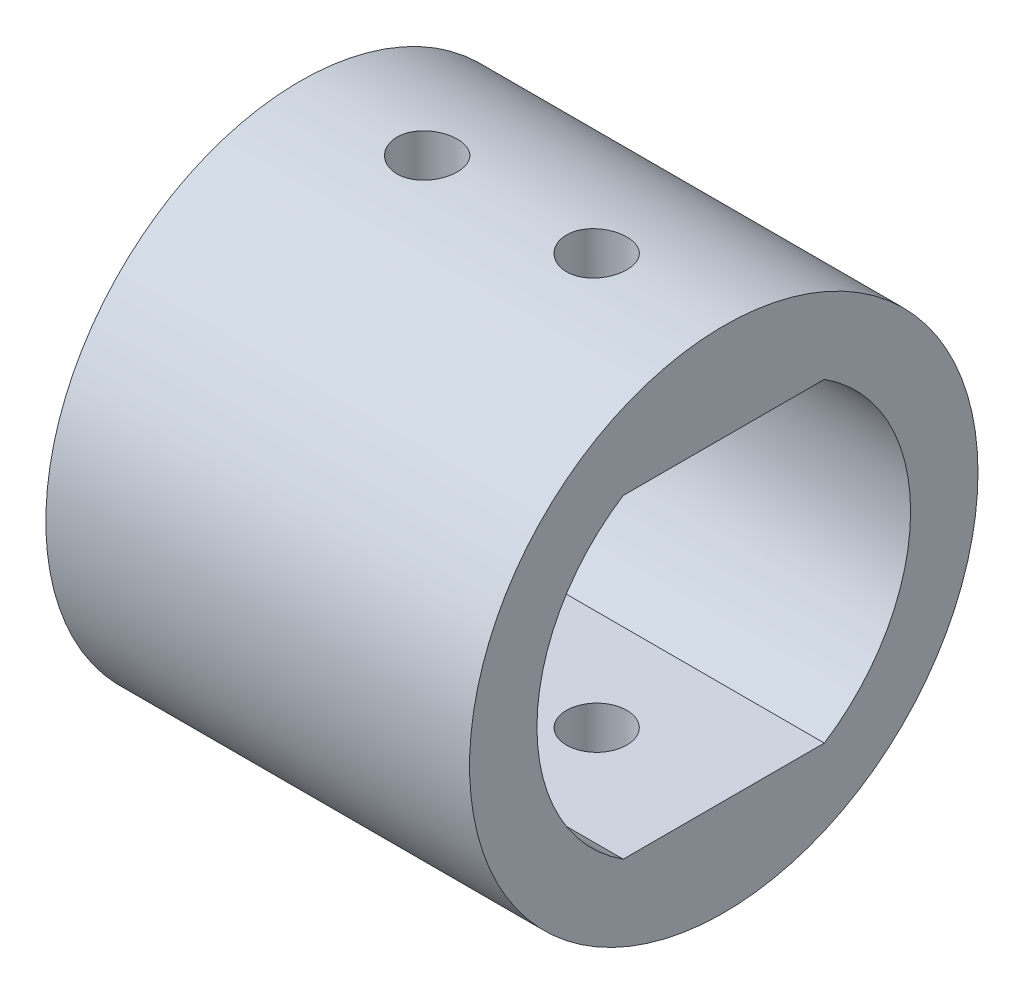
ISO-10303-21;
HEADER;
FILE_DESCRIPTION(('STEP AP214'),'2;1');
FILE_NAME('part.step','',(''),(''),'','','');
FILE_SCHEMA(('AUTOMOTIVE_DESIGN { 1 0 10303 214 1 1 1 1 }'));
ENDSEC;
DATA;
#1=APPLICATION_CONTEXT('core data for automotive mechanical design processes');
#2=APPLICATION_PROTOCOL_DEFINITION('international standard','automotive_design',2000,#1);
#3=PRODUCT_CONTEXT('',#1,'mechanical');
#4=PRODUCT('Part','Part','',(#3));
#5=PRODUCT_RELATED_PRODUCT_CATEGORY('part','',(#4));
#6=PRODUCT_DEFINITION_FORMATION('','',#4);
#7=PRODUCT_DEFINITION_CONTEXT('part definition',#1,'design');
#8=PRODUCT_DEFINITION('design','',#6,#7);
#9=PRODUCT_DEFINITION_SHAPE('','',#8);
#10=(LENGTH_UNIT() NAMED_UNIT(*) SI_UNIT(.MILLI.,.METRE.));
#11=(NAMED_UNIT(*) PLANE_ANGLE_UNIT() SI_UNIT($,.RADIAN.));
#12=(NAMED_UNIT(*) SI_UNIT($,.STERADIAN.) SOLID_ANGLE_UNIT());
#13=UNCERTAINTY_MEASURE_WITH_UNIT(LENGTH_MEASURE(1.E-05),#10,'distance_accuracy_value','');
#14=(GEOMETRIC_REPRESENTATION_CONTEXT(3) GLOBAL_UNCERTAINTY_ASSIGNED_CONTEXT((#13)) GLOBAL_UNIT_ASSIGNED_CONTEXT((#10,
#11,#12)) REPRESENTATION_CONTEXT('',''));
#15=CARTESIAN_POINT('',(0.,0.,0.));
#16=DIRECTION('',(0.,0.,1.));
#17=DIRECTION('',(1.,0.,0.));
#18=AXIS2_PLACEMENT_3D('',#15,#16,#17);
#19=CARTESIAN_POINT('',(7.9375,0.,0.));
#20=DIRECTION('',(-1.,0.,0.));
#21=DIRECTION('',(0.,0.,1.));
#22=AXIS2_PLACEMENT_3D('',#19,#20,#21);
#23=CYLINDRICAL_SURFACE('',#22,7.);
#24=CARTESIAN_POINT('',(-7.9375,0.,0.));
#25=DIRECTION('',(1.,0.,0.));
#26=DIRECTION('',(0.,0.,-1.));
#27=AXIS2_PLACEMENT_3D('',#24,#25,#26);
#28=CIRCLE('',#27,7.);
#29=CARTESIAN_POINT('',(-7.9375,5.9,3.76696164036747));
#30=VERTEX_POINT('',#29);
#31=CARTESIAN_POINT('',(-7.9375,-5.9,3.76696164036747));
#32=VERTEX_POINT('',#31);
#33=EDGE_CURVE('E122',#30,#32,#28,.T.);
#34=ORIENTED_EDGE('',*,*,#33,.F.);
#35=DIRECTION('',(-1.,0.,0.));
#36=VECTOR('',#35,1.);
#37=CARTESIAN_POINT('',(7.9375,5.9,3.76696164036747));
#38=LINE('',#37,#36);
#39=CARTESIAN_POINT('',(7.9375,5.9,3.76696164036747));
#40=VERTEX_POINT('',#39);
#41=EDGE_CURVE('E84',#40,#30,#38,.T.);
#42=ORIENTED_EDGE('',*,*,#41,.F.);
#43=CARTESIAN_POINT('',(7.9375,0.,0.));
#44=DIRECTION('',(1.,0.,0.));
#45=DIRECTION('',(0.,0.,-1.));
#46=AXIS2_PLACEMENT_3D('',#43,#44,#45);
#47=CIRCLE('',#46,7.);
#48=CARTESIAN_POINT('',(7.9375,-5.9,3.76696164036747));
#49=VERTEX_POINT('',#48);
#50=EDGE_CURVE('E97',#40,#49,#47,.T.);
#51=ORIENTED_EDGE('',*,*,#50,.T.);
#52=DIRECTION('',(-1.,0.,0.));
#53=VECTOR('',#52,1.);
#54=CARTESIAN_POINT('',(7.9375,-5.9,3.76696164036747));
#55=LINE('',#54,#53);
#56=EDGE_CURVE('E62',#49,#32,#55,.T.);
#57=ORIENTED_EDGE('',*,*,#56,.T.);
#58=EDGE_LOOP('',(#34,#42,#51,#57));
#59=FACE_BOUND('',#58,.T.);
#60=ADVANCED_FACE('F39',(#59),#23,.F.);
#61=CARTESIAN_POINT('',(7.9375,5.9,0.));
#62=DIRECTION('',(0.,1.,0.));
#63=DIRECTION('',(0.,0.,1.));
#64=AXIS2_PLACEMENT_3D('',#61,#62,#63);
#65=PLANE('',#64);
#66=CARTESIAN_POINT('',(-3.175,5.9,0.));
#67=DIRECTION('',(0.,1.,0.));
#68=DIRECTION('',(0.,0.,1.));
#69=AXIS2_PLACEMENT_3D('',#66,#67,#68);
#70=CIRCLE('',#69,1.1303);
#71=CARTESIAN_POINT('',(-3.175,5.9,1.1303));
#72=VERTEX_POINT('',#71);
#73=EDGE_CURVE('E125',#72,#72,#70,.T.);
#74=ORIENTED_EDGE('',*,*,#73,.T.);
#75=EDGE_LOOP('',(#74));
#76=FACE_BOUND('',#75,.T.);
#77=CARTESIAN_POINT('',(3.175,5.9,0.));
#78=DIRECTION('',(0.,1.,0.));
#79=DIRECTION('',(0.,0.,1.));
#80=AXIS2_PLACEMENT_3D('',#77,#78,#79);
#81=CIRCLE('',#80,1.1303);
#82=CARTESIAN_POINT('',(3.175,5.9,1.1303));
#83=VERTEX_POINT('',#82);
#84=EDGE_CURVE('E199',#83,#83,#81,.T.);
#85=ORIENTED_EDGE('',*,*,#84,.T.);
#86=EDGE_LOOP('',(#85));
#87=FACE_BOUND('',#86,.T.);
#88=DIRECTION('',(0.,0.,-1.));
#89=VECTOR('',#88,1.);
#90=CARTESIAN_POINT('',(-7.9375,5.9,0.));
#91=LINE('',#90,#89);
#92=CARTESIAN_POINT('',(-7.9375,5.9,-3.76696164036747));
#93=VERTEX_POINT('',#92);
#94=EDGE_CURVE('E105',#30,#93,#91,.T.);
#95=ORIENTED_EDGE('',*,*,#94,.T.);
#96=DIRECTION('',(-1.,0.,0.));
#97=VECTOR('',#96,1.);
#98=CARTESIAN_POINT('',(7.9375,5.9,-3.76696164036747));
#99=LINE('',#98,#97);
#100=CARTESIAN_POINT('',(7.9375,5.9,-3.76696164036747));
#101=VERTEX_POINT('',#100);
#102=EDGE_CURVE('E102',#101,#93,#99,.T.);
#103=ORIENTED_EDGE('',*,*,#102,.F.);
#104=DIRECTION('',(0.,0.,-1.));
#105=VECTOR('',#104,1.);
#106=CARTESIAN_POINT('',(7.9375,5.9,0.));
#107=LINE('',#106,#105);
#108=EDGE_CURVE('E90',#40,#101,#107,.T.);
#109=ORIENTED_EDGE('',*,*,#108,.F.);
#110=ORIENTED_EDGE('',*,*,#41,.T.);
#111=EDGE_LOOP('',(#95,#103,#109,#110));
#112=FACE_BOUND('',#111,.T.);
#113=ADVANCED_FACE('F103',(#76,#87,#112),#65,.F.);
#114=CARTESIAN_POINT('',(7.9375,0.,0.));
#115=DIRECTION('',(-1.,0.,0.));
#116=DIRECTION('',(0.,0.,1.));
#117=AXIS2_PLACEMENT_3D('',#114,#115,#116);
#118=CYLINDRICAL_SURFACE('',#117,7.);
#119=CARTESIAN_POINT('',(-7.9375,0.,0.));
#120=DIRECTION('',(1.,0.,0.));
#121=DIRECTION('',(0.,0.,-1.));
#122=AXIS2_PLACEMENT_3D('',#119,#120,#121);
#123=CIRCLE('',#122,7.);
#124=CARTESIAN_POINT('',(-7.9375,-5.9,-3.76696164036747));
#125=VERTEX_POINT('',#124);
#126=EDGE_CURVE('E128',#125,#93,#123,.T.);
#127=ORIENTED_EDGE('',*,*,#126,.F.);
#128=DIRECTION('',(-1.,0.,0.));
#129=VECTOR('',#128,1.);
#130=CARTESIAN_POINT('',(7.9375,-5.9,-3.76696164036747));
#131=LINE('',#130,#129);
#132=CARTESIAN_POINT('',(7.9375,-5.9,-3.76696164036747));
#133=VERTEX_POINT('',#132);
#134=EDGE_CURVE('E76',#133,#125,#131,.T.);
#135=ORIENTED_EDGE('',*,*,#134,.F.);
#136=CARTESIAN_POINT('',(7.9375,0.,0.));
#137=DIRECTION('',(1.,0.,0.));
#138=DIRECTION('',(0.,0.,-1.));
#139=AXIS2_PLACEMENT_3D('',#136,#137,#138);
#140=CIRCLE('',#139,7.);
#141=EDGE_CURVE('E96',#133,#101,#140,.T.);
#142=ORIENTED_EDGE('',*,*,#141,.T.);
#143=ORIENTED_EDGE('',*,*,#102,.T.);
#144=EDGE_LOOP('',(#127,#135,#142,#143));
#145=FACE_BOUND('',#144,.T.);
#146=ADVANCED_FACE('F110',(#145),#118,.F.);
#147=CARTESIAN_POINT('',(7.9375,-5.9,0.));
#148=DIRECTION('',(0.,1.,0.));
#149=DIRECTION('',(0.,0.,1.));
#150=AXIS2_PLACEMENT_3D('',#147,#148,#149);
#151=PLANE('',#150);
#152=CARTESIAN_POINT('',(-3.175,-5.9,0.));
#153=DIRECTION('',(0.,1.,0.));
#154=DIRECTION('',(0.,0.,1.));
#155=AXIS2_PLACEMENT_3D('',#152,#153,#154);
#156=CIRCLE('',#155,1.1303);
#157=CARTESIAN_POINT('',(-3.175,-5.9,1.1303));
#158=VERTEX_POINT('',#157);
#159=EDGE_CURVE('E193',#158,#158,#156,.T.);
#160=ORIENTED_EDGE('',*,*,#159,.F.);
#161=EDGE_LOOP('',(#160));
#162=FACE_BOUND('',#161,.T.);
#163=CARTESIAN_POINT('',(3.175,-5.9,0.));
#164=DIRECTION('',(0.,1.,0.));
#165=DIRECTION('',(0.,0.,1.));
#166=AXIS2_PLACEMENT_3D('',#163,#164,#165);
#167=CIRCLE('',#166,1.1303);
#168=CARTESIAN_POINT('',(3.175,-5.9,1.1303));
#169=VERTEX_POINT('',#168);
#170=EDGE_CURVE('E196',#169,#169,#167,.T.);
#171=ORIENTED_EDGE('',*,*,#170,.F.);
#172=EDGE_LOOP('',(#171));
#173=FACE_BOUND('',#172,.T.);
#174=DIRECTION('',(0.,0.,-1.));
#175=VECTOR('',#174,1.);
#176=CARTESIAN_POINT('',(-7.9375,-5.9,0.));
#177=LINE('',#176,#175);
#178=EDGE_CURVE('E131',#32,#125,#177,.T.);
#179=ORIENTED_EDGE('',*,*,#178,.F.);
#180=ORIENTED_EDGE('',*,*,#56,.F.);
#181=DIRECTION('',(0.,0.,-1.));
#182=VECTOR('',#181,1.);
#183=CARTESIAN_POINT('',(7.9375,-5.9,0.));
#184=LINE('',#183,#182);
#185=EDGE_CURVE('E112',#49,#133,#184,.T.);
#186=ORIENTED_EDGE('',*,*,#185,.T.);
#187=ORIENTED_EDGE('',*,*,#134,.T.);
#188=EDGE_LOOP('',(#179,#180,#186,#187));
#189=FACE_BOUND('',#188,.T.);
#190=ADVANCED_FACE('F181',(#162,#173,#189),#151,.T.);
#191=CARTESIAN_POINT('',(7.9375,0.,0.));
#192=DIRECTION('',(-1.,0.,0.));
#193=DIRECTION('',(0.,0.,1.));
#194=AXIS2_PLACEMENT_3D('',#191,#192,#193);
#195=CYLINDRICAL_SURFACE('',#194,9.525);
#196=CARTESIAN_POINT('',(-3.175,9.45769775949729,1.1303));
#197=CARTESIAN_POINT('',(-3.23824916976848,9.45769862718058,1.13029729598091));
#198=CARTESIAN_POINT('',(-3.30153849953314,9.45833908328995,1.12497316275731));
#199=CARTESIAN_POINT('',(-3.42635762857342,9.46083090750719,1.10381729162108));
#200=CARTESIAN_POINT('',(-3.48788548939699,9.46268355989146,1.08797440922644));
#201=CARTESIAN_POINT('',(-3.60735632461924,9.46738704222719,1.04625308620623));
#202=CARTESIAN_POINT('',(-3.66530163170046,9.47023721444242,1.02038125717666));
#203=CARTESIAN_POINT('',(-3.77601666251184,9.47661379731083,0.959350224752229));
#204=CARTESIAN_POINT('',(-3.82878730780231,9.48014008722181,0.924192679193433));
#205=CARTESIAN_POINT('',(-3.92793325161707,9.48749155945359,0.845397586021794));
#206=CARTESIAN_POINT('',(-3.97427860824603,9.491318019046,0.801722478390805));
#207=CARTESIAN_POINT('',(-4.05899996894538,9.49882717289779,0.70721277256907));
#208=CARTESIAN_POINT('',(-4.09737558547415,9.50250986015894,0.656377826421095));
#209=CARTESIAN_POINT('',(-4.16517461646272,9.50932950061834,0.548804366863592));
#210=CARTESIAN_POINT('',(-4.19457107215468,9.51246479850961,0.492048748609835));
#211=CARTESIAN_POINT('',(-4.24340471319634,9.5178223911594,0.374363093305485));
#212=CARTESIAN_POINT('',(-4.26284223326057,9.52004471660192,0.313433196628211));
#213=CARTESIAN_POINT('',(-4.29111716550103,9.52331697940384,0.189434001960021));
#214=CARTESIAN_POINT('',(-4.30000422990086,9.52437240675603,0.126376173112619));
#215=CARTESIAN_POINT('',(-4.30707979205946,9.52521068375437,-0.000344122305609714));
#216=CARTESIAN_POINT('',(-4.30526867144282,9.52499357879418,-0.0640065672277504));
#217=CARTESIAN_POINT('',(-4.29103920606598,9.5233157085376,-0.189791341572358));
#218=CARTESIAN_POINT('',(-4.2786742581653,9.52186120395862,-0.251919806779137));
#219=CARTESIAN_POINT('',(-4.24377152603821,9.51787903391902,-0.373213518763547));
#220=CARTESIAN_POINT('',(-4.22123356473929,9.51535134977857,-0.432378713942282));
#221=CARTESIAN_POINT('',(-4.16656731052756,9.50949608877205,-0.546232535258128));
#222=CARTESIAN_POINT('',(-4.1344157673226,9.50616657654033,-0.60090989433039));
#223=CARTESIAN_POINT('',(-4.06145191720071,9.49908046607103,-0.704113036985985));
#224=CARTESIAN_POINT('',(-4.02063925222401,9.49532385017953,-0.752638566113756));
#225=CARTESIAN_POINT('',(-3.93121226959251,9.48777694820432,-0.842474035276456));
#226=CARTESIAN_POINT('',(-3.88255143868043,9.48398659726572,-0.883737681950874));
#227=CARTESIAN_POINT('',(-3.77896961346334,9.4768223283503,-0.957518652670657));
#228=CARTESIAN_POINT('',(-3.72404860286375,9.47344841145744,-0.990035953949487));
#229=CARTESIAN_POINT('',(-3.6094657322383,9.46749898010504,-1.0454030436631));
#230=CARTESIAN_POINT('',(-3.54980217711299,9.46492375274304,-1.06824935683133));
#231=CARTESIAN_POINT('',(-3.42744821943478,9.46086898380371,-1.10358611116931));
#232=CARTESIAN_POINT('',(-3.36475794802235,9.45938939480026,-1.11607700058983));
#233=CARTESIAN_POINT('',(-3.23853829023288,9.45770199014614,-1.13028751220767));
#234=CARTESIAN_POINT('',(-3.17501632549279,9.45748649494197,-1.13207217777638));
#235=CARTESIAN_POINT('',(-3.04857854353881,9.4583313807212,-1.12499098103634));
#236=CARTESIAN_POINT('',(-2.98566271473382,9.45939173725754,-1.11612532280234));
#237=CARTESIAN_POINT('',(-2.86241660962486,9.46266185072345,-1.08804981318816));
#238=CARTESIAN_POINT('',(-2.80207910475548,9.46486812992943,-1.06887125391347));
#239=CARTESIAN_POINT('',(-2.68547666647221,9.47017867995706,-1.02074648918646));
#240=CARTESIAN_POINT('',(-2.62921186276153,9.47328297936222,-0.991799972820342));
#241=CARTESIAN_POINT('',(-2.5220570981924,9.48005824688151,-0.924800232377516));
#242=CARTESIAN_POINT('',(-2.47119405310682,9.48373184715418,-0.886704231529676));
#243=CARTESIAN_POINT('',(-2.37656078778812,9.49122344028545,-0.802547627123672));
#244=CARTESIAN_POINT('',(-2.33279081583712,9.4950414381927,-0.75648674488369));
#245=CARTESIAN_POINT('',(-2.25335882489087,9.50241511902043,-0.657424275109199));
#246=CARTESIAN_POINT('',(-2.21773946200383,9.50596935894309,-0.604388361657209));
#247=CARTESIAN_POINT('',(-2.15591449742253,9.51239364404868,-0.493048965900749));
#248=CARTESIAN_POINT('',(-2.12970872218702,9.51526370184431,-0.434745580727906));
#249=CARTESIAN_POINT('',(-2.08752576407364,9.51998981336182,-0.314669957235084));
#250=CARTESIAN_POINT('',(-2.07152362585643,9.5218483393725,-0.252906587121844));
#251=CARTESIAN_POINT('',(-2.05012092449964,9.52435221743971,-0.12754623527732));
#252=CARTESIAN_POINT('',(-2.04471993284648,9.52499761853245,-0.0639493277656949));
#253=CARTESIAN_POINT('',(-2.04468029857384,9.52500235390677,0.0628556479824202));
#254=CARTESIAN_POINT('',(-2.04997576236484,9.52436956226478,0.126063705513361));
#255=CARTESIAN_POINT('',(-2.07103953947349,9.52190462521891,0.250684984413589));
#256=CARTESIAN_POINT('',(-2.08680785031618,9.52007248009848,0.31209820620703));
#257=CARTESIAN_POINT('',(-2.12834966910498,9.51541385608962,0.431380067380626));
#258=CARTESIAN_POINT('',(-2.1541203486888,9.5125876583099,0.489249703426965));
#259=CARTESIAN_POINT('',(-2.21492853525092,9.50625444540433,0.599853154793376));
#260=CARTESIAN_POINT('',(-2.24996610802963,9.50274742544428,0.652586933642185));
#261=CARTESIAN_POINT('',(-2.32855835431538,9.49541862334329,0.751758792815968));
#262=CARTESIAN_POINT('',(-2.37216210287417,9.49159510470678,0.798157855449946));
#263=CARTESIAN_POINT('',(-2.46654788869246,9.48407840461348,0.883006880795346));
#264=CARTESIAN_POINT('',(-2.51733162909704,9.48038525434148,0.921454952130811));
#265=CARTESIAN_POINT('',(-2.62483714734645,9.47353370418922,0.98942342028143));
#266=CARTESIAN_POINT('',(-2.68157902520976,9.47037721505064,1.01891219974434));
#267=CARTESIAN_POINT('',(-2.79921387200613,9.46497883214028,1.06790149267205));
#268=CARTESIAN_POINT('',(-2.86010219624436,9.46273593404493,1.08741298037643));
#269=CARTESIAN_POINT('',(-2.96359510485225,9.45996908722804,1.11116894868368));
#270=CARTESIAN_POINT('',(-3.00554427963409,9.45912152185399,1.11833291869403));
#271=CARTESIAN_POINT('',(-3.08998959038909,9.4579855682106,1.12789933748409));
#272=CARTESIAN_POINT('',(-3.13248572276489,9.45769717626547,1.13030181756405));
#273=CARTESIAN_POINT('',(-3.175,9.45769775949729,1.1303));
#274=B_SPLINE_CURVE_WITH_KNOTS('',3,(#196,#197,#198,#199,#200,#201,#202,#203,#204,#205,#206,
#207,#208,#209,#210,#211,#212,#213,#214,#215,#216,#217,#218,#219,#220,#221,#222,#223,#224,#225,
#226,#227,#228,#229,#230,#231,#232,#233,#234,#235,#236,#237,#238,#239,#240,#241,#242,#243,#244,
#245,#246,#247,#248,#249,#250,#251,#252,#253,#254,#255,#256,#257,#258,#259,#260,#261,#262,#263,
#264,#265,#266,#267,#268,#269,#270,#271,#272,#273),.UNSPECIFIED.,.T.,.F.,(4,2,2,2,2,2,2,2,2,2,2,
2,2,2,2,2,2,2,2,2,2,2,2,2,2,2,2,2,2,2,2,2,2,2,2,2,2,2,4),(0.,0.18959221388925,0.379385619561867,
0.569054115897612,0.758688772414149,0.949179385544422,1.13967925942422,1.33074558653033,
1.52180549157747,1.71196262630949,1.90211297781599,2.09130693212657,2.28050417969351,
2.4701627505348,2.65982916358627,2.85066401887307,3.04149937089377,3.23240324144272,
3.42329884798683,3.61303352504167,3.80276456657905,3.99192313524191,4.18108772538462,
4.37115455334502,4.56122803286597,4.7522745994211,4.94331764381635,5.13389163804312,
5.32445792883671,5.51385385073963,5.70324972788426,5.89259208867053,6.08193579393566,
6.27239765084127,6.46290476268864,6.65407656758035,6.84503764369971,6.97247692802296,
7.09991537460509),.UNSPECIFIED.);
#275=CARTESIAN_POINT('',(-3.175,9.45769775949729,1.1303));
#276=VERTEX_POINT('',#275);
#277=EDGE_CURVE('E42',#276,#276,#274,.T.);
#278=ORIENTED_EDGE('',*,*,#277,.T.);
#279=EDGE_LOOP('',(#278));
#280=FACE_BOUND('',#279,.T.);
#281=CARTESIAN_POINT('',(-3.175,-9.45769775949729,1.1303));
#282=CARTESIAN_POINT('',(-3.11175083023152,-9.45769862718058,1.13029729598091));
#283=CARTESIAN_POINT('',(-3.04846150046686,-9.45833908328995,1.12497316275731));
#284=CARTESIAN_POINT('',(-2.92364237142658,-9.46083090750719,1.10381729162108));
#285=CARTESIAN_POINT('',(-2.86211451060301,-9.46268355989146,1.08797440922644));
#286=CARTESIAN_POINT('',(-2.74264367538076,-9.46738704222719,1.04625308620623));
#287=CARTESIAN_POINT('',(-2.68469836829954,-9.47023721444242,1.02038125717666));
#288=CARTESIAN_POINT('',(-2.57398333748816,-9.47661379731083,0.95935022475223));
#289=CARTESIAN_POINT('',(-2.52121269219769,-9.48014008722181,0.924192679193433));
#290=CARTESIAN_POINT('',(-2.42206674838293,-9.48749155945359,0.845397586021794));
#291=CARTESIAN_POINT('',(-2.37572139175397,-9.491318019046,0.801722478390805));
#292=CARTESIAN_POINT('',(-2.29100003105462,-9.49882717289779,0.707212772569069));
#293=CARTESIAN_POINT('',(-2.25262441452585,-9.50250986015894,0.656377826421095));
#294=CARTESIAN_POINT('',(-2.18482538353728,-9.50932950061834,0.548804366863592));
#295=CARTESIAN_POINT('',(-2.15542892784532,-9.51246479850961,0.492048748609835));
#296=CARTESIAN_POINT('',(-2.10659528680366,-9.5178223911594,0.374363093305484));
#297=CARTESIAN_POINT('',(-2.08715776673943,-9.52004471660192,0.313433196628211));
#298=CARTESIAN_POINT('',(-2.05888283449897,-9.52331697940384,0.189434001960021));
#299=CARTESIAN_POINT('',(-2.04999577009914,-9.52437240675603,0.126376173112619));
#300=CARTESIAN_POINT('',(-2.04292020794054,-9.52521068375437,-0.000344122305609903));
#301=CARTESIAN_POINT('',(-2.04473132855718,-9.52499357879418,-0.0640065672277506));
#302=CARTESIAN_POINT('',(-2.05896079393402,-9.5233157085376,-0.189791341572358));
#303=CARTESIAN_POINT('',(-2.0713257418347,-9.52186120395862,-0.251919806779137));
#304=CARTESIAN_POINT('',(-2.10622847396179,-9.51787903391902,-0.373213518763547));
#305=CARTESIAN_POINT('',(-2.12876643526071,-9.51535134977857,-0.432378713942282));
#306=CARTESIAN_POINT('',(-2.18343268947244,-9.50949608877205,-0.546232535258128));
#307=CARTESIAN_POINT('',(-2.2155842326774,-9.50616657654033,-0.60090989433039));
#308=CARTESIAN_POINT('',(-2.28854808279929,-9.49908046607103,-0.704113036985985));
#309=CARTESIAN_POINT('',(-2.32936074777599,-9.49532385017953,-0.752638566113756));
#310=CARTESIAN_POINT('',(-2.41878773040749,-9.48777694820432,-0.842474035276456));
#311=CARTESIAN_POINT('',(-2.46744856131957,-9.48398659726572,-0.883737681950874));
#312=CARTESIAN_POINT('',(-2.57103038653666,-9.4768223283503,-0.957518652670657));
#313=CARTESIAN_POINT('',(-2.62595139713625,-9.47344841145744,-0.990035953949487));
#314=CARTESIAN_POINT('',(-2.7405342677617,-9.46749898010504,-1.0454030436631));
#315=CARTESIAN_POINT('',(-2.80019782288701,-9.46492375274304,-1.06824935683133));
#316=CARTESIAN_POINT('',(-2.92255178056522,-9.46086898380371,-1.10358611116931));
#317=CARTESIAN_POINT('',(-2.98524205197765,-9.45938939480026,-1.11607700058983));
#318=CARTESIAN_POINT('',(-3.11146170976712,-9.45770199014614,-1.13028751220767));
#319=CARTESIAN_POINT('',(-3.17498367450721,-9.45748649494197,-1.13207217777638));
#320=CARTESIAN_POINT('',(-3.30142145646119,-9.4583313807212,-1.12499098103634));
#321=CARTESIAN_POINT('',(-3.36433728526618,-9.45939173725754,-1.11612532280234));
#322=CARTESIAN_POINT('',(-3.48758339037514,-9.46266185072345,-1.08804981318816));
#323=CARTESIAN_POINT('',(-3.54792089524452,-9.46486812992943,-1.06887125391347));
#324=CARTESIAN_POINT('',(-3.66452333352779,-9.47017867995706,-1.02074648918646));
#325=CARTESIAN_POINT('',(-3.72078813723847,-9.47328297936222,-0.991799972820342));
#326=CARTESIAN_POINT('',(-3.8279429018076,-9.48005824688151,-0.924800232377515));
#327=CARTESIAN_POINT('',(-3.87880594689318,-9.48373184715418,-0.886704231529675));
#328=CARTESIAN_POINT('',(-3.97343921221188,-9.49122344028545,-0.802547627123672));
#329=CARTESIAN_POINT('',(-4.01720918416288,-9.4950414381927,-0.756486744883689));
#330=CARTESIAN_POINT('',(-4.09664117510913,-9.50241511902043,-0.657424275109199));
#331=CARTESIAN_POINT('',(-4.13226053799617,-9.50596935894309,-0.604388361657209));
#332=CARTESIAN_POINT('',(-4.19408550257748,-9.51239364404868,-0.49304896590075));
#333=CARTESIAN_POINT('',(-4.22029127781298,-9.51526370184431,-0.434745580727906));
#334=CARTESIAN_POINT('',(-4.26247423592636,-9.51998981336182,-0.314669957235084));
#335=CARTESIAN_POINT('',(-4.27847637414357,-9.5218483393725,-0.252906587121844));
#336=CARTESIAN_POINT('',(-4.29987907550036,-9.52435221743971,-0.127546235277319));
#337=CARTESIAN_POINT('',(-4.30528006715352,-9.52499761853245,-0.0639493277656946));
#338=CARTESIAN_POINT('',(-4.30531970142616,-9.52500235390677,0.0628556479824207));
#339=CARTESIAN_POINT('',(-4.30002423763516,-9.52436956226478,0.126063705513362));
#340=CARTESIAN_POINT('',(-4.27896046052651,-9.52190462521891,0.25068498441359));
#341=CARTESIAN_POINT('',(-4.26319214968382,-9.52007248009848,0.312098206207031));
#342=CARTESIAN_POINT('',(-4.22165033089502,-9.51541385608962,0.431380067380627));
#343=CARTESIAN_POINT('',(-4.1958796513112,-9.5125876583099,0.489249703426966));
#344=CARTESIAN_POINT('',(-4.13507146474908,-9.50625444540433,0.599853154793377));
#345=CARTESIAN_POINT('',(-4.10003389197037,-9.50274742544428,0.652586933642186));
#346=CARTESIAN_POINT('',(-4.02144164568462,-9.49541862334329,0.751758792815968));
#347=CARTESIAN_POINT('',(-3.97783789712583,-9.49159510470678,0.798157855449947));
#348=CARTESIAN_POINT('',(-3.88345211130754,-9.48407840461348,0.883006880795346));
#349=CARTESIAN_POINT('',(-3.83266837090296,-9.48038525434148,0.921454952130811));
#350=CARTESIAN_POINT('',(-3.72516285265355,-9.47353370418922,0.98942342028143));
#351=CARTESIAN_POINT('',(-3.66842097479024,-9.47037721505064,1.01891219974434));
#352=CARTESIAN_POINT('',(-3.55078612799387,-9.46497883214028,1.06790149267205));
#353=CARTESIAN_POINT('',(-3.48989780375564,-9.46273593404493,1.08741298037643));
#354=CARTESIAN_POINT('',(-3.38640489514775,-9.45996908722804,1.11116894868368));
#355=CARTESIAN_POINT('',(-3.34445572036591,-9.45912152185399,1.11833291869403));
#356=CARTESIAN_POINT('',(-3.26001040961091,-9.4579855682106,1.12789933748409));
#357=CARTESIAN_POINT('',(-3.21751427723511,-9.45769717626547,1.13030181756405));
#358=CARTESIAN_POINT('',(-3.175,-9.45769775949729,1.1303));
#359=B_SPLINE_CURVE_WITH_KNOTS('',3,(#281,#282,#283,#284,#285,#286,#287,#288,#289,#290,#291,
#292,#293,#294,#295,#296,#297,#298,#299,#300,#301,#302,#303,#304,#305,#306,#307,#308,#309,#310,
#311,#312,#313,#314,#315,#316,#317,#318,#319,#320,#321,#322,#323,#324,#325,#326,#327,#328,#329,
#330,#331,#332,#333,#334,#335,#336,#337,#338,#339,#340,#341,#342,#343,#344,#345,#346,#347,#348,
#349,#350,#351,#352,#353,#354,#355,#356,#357,#358),.UNSPECIFIED.,.T.,.F.,(4,2,2,2,2,2,2,2,2,2,2,
2,2,2,2,2,2,2,2,2,2,2,2,2,2,2,2,2,2,2,2,2,2,2,2,2,2,2,4),(0.,0.18959221388925,0.379385619561867,
0.569054115897612,0.758688772414149,0.949179385544422,1.13967925942423,1.33074558653033,
1.52180549157747,1.71196262630949,1.90211297781599,2.09130693212657,2.28050417969351,
2.4701627505348,2.65982916358627,2.85066401887307,3.04149937089377,3.23240324144272,
3.42329884798683,3.61303352504167,3.80276456657905,3.99192313524191,4.18108772538462,
4.37115455334502,4.56122803286597,4.7522745994211,4.94331764381635,5.13389163804312,
5.32445792883671,5.51385385073963,5.70324972788426,5.89259208867053,6.08193579393566,
6.27239765084127,6.46290476268864,6.65407656758035,6.84503764369971,6.97247692802296,
7.09991537460509),.UNSPECIFIED.);
#360=CARTESIAN_POINT('',(-3.175,-9.45769775949729,1.1303));
#361=VERTEX_POINT('',#360);
#362=EDGE_CURVE('E11',#361,#361,#359,.T.);
#363=ORIENTED_EDGE('',*,*,#362,.T.);
#364=EDGE_LOOP('',(#363));
#365=FACE_BOUND('',#364,.T.);
#366=CARTESIAN_POINT('',(3.175,9.45769775949729,1.1303));
#367=CARTESIAN_POINT('',(3.11175083023152,9.45769862718058,1.13029729598091));
#368=CARTESIAN_POINT('',(3.04846150046686,9.45833908328995,1.12497316275731));
#369=CARTESIAN_POINT('',(2.92364237142658,9.46083090750719,1.10381729162108));
#370=CARTESIAN_POINT('',(2.86211451060301,9.46268355989146,1.08797440922644));
#371=CARTESIAN_POINT('',(2.74264367538076,9.46738704222719,1.04625308620623));
#372=CARTESIAN_POINT('',(2.68469836829954,9.47023721444242,1.02038125717666));
#373=CARTESIAN_POINT('',(2.57398333748816,9.47661379731083,0.95935022475223));
#374=CARTESIAN_POINT('',(2.52121269219769,9.48014008722181,0.924192679193433));
#375=CARTESIAN_POINT('',(2.42206674838293,9.48749155945359,0.845397586021794));
#376=CARTESIAN_POINT('',(2.37572139175397,9.491318019046,0.801722478390805));
#377=CARTESIAN_POINT('',(2.29100003105462,9.49882717289779,0.70721277256907));
#378=CARTESIAN_POINT('',(2.25262441452585,9.50250986015894,0.656377826421095));
#379=CARTESIAN_POINT('',(2.18482538353728,9.50932950061834,0.548804366863592));
#380=CARTESIAN_POINT('',(2.15542892784532,9.51246479850961,0.492048748609835));
#381=CARTESIAN_POINT('',(2.10659528680366,9.5178223911594,0.374363093305484));
#382=CARTESIAN_POINT('',(2.08715776673943,9.52004471660192,0.313433196628211));
#383=CARTESIAN_POINT('',(2.05888283449897,9.52331697940384,0.189434001960021));
#384=CARTESIAN_POINT('',(2.04999577009914,9.52437240675603,0.126376173112619));
#385=CARTESIAN_POINT('',(2.04292020794054,9.52521068375437,-0.000344122305609727));
#386=CARTESIAN_POINT('',(2.04473132855718,9.52499357879418,-0.0640065672277505));
#387=CARTESIAN_POINT('',(2.05896079393402,9.5233157085376,-0.189791341572358));
#388=CARTESIAN_POINT('',(2.0713257418347,9.52186120395862,-0.251919806779137));
#389=CARTESIAN_POINT('',(2.10622847396179,9.51787903391902,-0.373213518763548));
#390=CARTESIAN_POINT('',(2.12876643526071,9.51535134977857,-0.432378713942282));
#391=CARTESIAN_POINT('',(2.18343268947244,9.50949608877205,-0.546232535258129));
#392=CARTESIAN_POINT('',(2.2155842326774,9.50616657654033,-0.60090989433039));
#393=CARTESIAN_POINT('',(2.28854808279929,9.49908046607103,-0.704113036985985));
#394=CARTESIAN_POINT('',(2.32936074777599,9.49532385017953,-0.752638566113757));
#395=CARTESIAN_POINT('',(2.41878773040749,9.48777694820432,-0.842474035276456));
#396=CARTESIAN_POINT('',(2.46744856131957,9.48398659726572,-0.883737681950874));
#397=CARTESIAN_POINT('',(2.57103038653666,9.4768223283503,-0.957518652670657));
#398=CARTESIAN_POINT('',(2.62595139713625,9.47344841145744,-0.990035953949487));
#399=CARTESIAN_POINT('',(2.7405342677617,9.46749898010504,-1.0454030436631));
#400=CARTESIAN_POINT('',(2.80019782288701,9.46492375274304,-1.06824935683133));
#401=CARTESIAN_POINT('',(2.92255178056522,9.46086898380371,-1.10358611116931));
#402=CARTESIAN_POINT('',(2.98524205197765,9.45938939480026,-1.11607700058983));
#403=CARTESIAN_POINT('',(3.11146170976712,9.45770199014614,-1.13028751220767));
#404=CARTESIAN_POINT('',(3.17498367450721,9.45748649494197,-1.13207217777638));
#405=CARTESIAN_POINT('',(3.30142145646119,9.4583313807212,-1.12499098103634));
#406=CARTESIAN_POINT('',(3.36433728526618,9.45939173725754,-1.11612532280234));
#407=CARTESIAN_POINT('',(3.48758339037514,9.46266185072345,-1.08804981318816));
#408=CARTESIAN_POINT('',(3.54792089524452,9.46486812992943,-1.06887125391347));
#409=CARTESIAN_POINT('',(3.66452333352779,9.47017867995706,-1.02074648918646));
#410=CARTESIAN_POINT('',(3.72078813723847,9.47328297936222,-0.991799972820342));
#411=CARTESIAN_POINT('',(3.8279429018076,9.48005824688151,-0.924800232377515));
#412=CARTESIAN_POINT('',(3.87880594689318,9.48373184715418,-0.886704231529675));
#413=CARTESIAN_POINT('',(3.97343921221188,9.49122344028545,-0.802547627123672));
#414=CARTESIAN_POINT('',(4.01720918416288,9.4950414381927,-0.756486744883689));
#415=CARTESIAN_POINT('',(4.09664117510913,9.50241511902043,-0.657424275109199));
#416=CARTESIAN_POINT('',(4.13226053799617,9.50596935894309,-0.604388361657209));
#417=CARTESIAN_POINT('',(4.19408550257748,9.51239364404868,-0.49304896590075));
#418=CARTESIAN_POINT('',(4.22029127781298,9.51526370184431,-0.434745580727906));
#419=CARTESIAN_POINT('',(4.26247423592636,9.51998981336182,-0.314669957235084));
#420=CARTESIAN_POINT('',(4.27847637414357,9.5218483393725,-0.252906587121844));
#421=CARTESIAN_POINT('',(4.29987907550036,9.52435221743971,-0.127546235277319));
#422=CARTESIAN_POINT('',(4.30528006715352,9.52499761853245,-0.0639493277656945));
#423=CARTESIAN_POINT('',(4.30531970142616,9.52500235390677,0.0628556479824208));
#424=CARTESIAN_POINT('',(4.30002423763516,9.52436956226478,0.126063705513362));
#425=CARTESIAN_POINT('',(4.27896046052651,9.52190462521891,0.25068498441359));
#426=CARTESIAN_POINT('',(4.26319214968382,9.52007248009848,0.312098206207031));
#427=CARTESIAN_POINT('',(4.22165033089502,9.51541385608962,0.431380067380627));
#428=CARTESIAN_POINT('',(4.1958796513112,9.5125876583099,0.489249703426966));
#429=CARTESIAN_POINT('',(4.13507146474908,9.50625444540433,0.599853154793377));
#430=CARTESIAN_POINT('',(4.10003389197037,9.50274742544428,0.652586933642186));
#431=CARTESIAN_POINT('',(4.02144164568462,9.49541862334329,0.751758792815969));
#432=CARTESIAN_POINT('',(3.97783789712583,9.49159510470678,0.798157855449947));
#433=CARTESIAN_POINT('',(3.88345211130754,9.48407840461348,0.883006880795346));
#434=CARTESIAN_POINT('',(3.83266837090296,9.48038525434148,0.921454952130811));
#435=CARTESIAN_POINT('',(3.72516285265355,9.47353370418922,0.989423420281431));
#436=CARTESIAN_POINT('',(3.66842097479023,9.47037721505064,1.01891219974434));
#437=CARTESIAN_POINT('',(3.55078612799387,9.46497883214028,1.06790149267205));
#438=CARTESIAN_POINT('',(3.48989780375564,9.46273593404493,1.08741298037643));
#439=CARTESIAN_POINT('',(3.38640489514775,9.45996908722804,1.11116894868368));
#440=CARTESIAN_POINT('',(3.34445572036591,9.45912152185399,1.11833291869403));
#441=CARTESIAN_POINT('',(3.26001040961091,9.4579855682106,1.12789933748409));
#442=CARTESIAN_POINT('',(3.21751427723511,9.45769717626547,1.13030181756405));
#443=CARTESIAN_POINT('',(3.175,9.45769775949729,1.1303));
#444=B_SPLINE_CURVE_WITH_KNOTS('',3,(#366,#367,#368,#369,#370,#371,#372,#373,#374,#375,#376,
#377,#378,#379,#380,#381,#382,#383,#384,#385,#386,#387,#388,#389,#390,#391,#392,#393,#394,#395,
#396,#397,#398,#399,#400,#401,#402,#403,#404,#405,#406,#407,#408,#409,#410,#411,#412,#413,#414,
#415,#416,#417,#418,#419,#420,#421,#422,#423,#424,#425,#426,#427,#428,#429,#430,#431,#432,#433,
#434,#435,#436,#437,#438,#439,#440,#441,#442,#443),.UNSPECIFIED.,.T.,.F.,(4,2,2,2,2,2,2,2,2,2,2,
2,2,2,2,2,2,2,2,2,2,2,2,2,2,2,2,2,2,2,2,2,2,2,2,2,2,2,4),(0.,0.18959221388925,0.379385619561867,
0.569054115897611,0.758688772414149,0.949179385544422,1.13967925942423,1.33074558653033,
1.52180549157747,1.71196262630949,1.90211297781599,2.09130693212657,2.28050417969351,
2.4701627505348,2.65982916358627,2.85066401887307,3.04149937089377,3.23240324144272,
3.42329884798683,3.61303352504167,3.80276456657905,3.99192313524191,4.18108772538462,
4.37115455334502,4.56122803286597,4.7522745994211,4.94331764381635,5.13389163804312,
5.32445792883671,5.51385385073963,5.70324972788426,5.89259208867053,6.08193579393567,
6.27239765084127,6.46290476268864,6.65407656758035,6.84503764369971,6.97247692802296,
7.09991537460509),.UNSPECIFIED.);
#445=CARTESIAN_POINT('',(3.175,9.45769775949729,1.1303));
#446=VERTEX_POINT('',#445);
#447=EDGE_CURVE('E152',#446,#446,#444,.T.);
#448=ORIENTED_EDGE('',*,*,#447,.T.);
#449=EDGE_LOOP('',(#448));
#450=FACE_BOUND('',#449,.T.);
#451=CARTESIAN_POINT('',(3.175,-9.45769775949729,1.1303));
#452=CARTESIAN_POINT('',(3.23824916976848,-9.45769862718058,1.13029729598091));
#453=CARTESIAN_POINT('',(3.30153849953314,-9.45833908328995,1.12497316275731));
#454=CARTESIAN_POINT('',(3.42635762857342,-9.46083090750719,1.10381729162108));
#455=CARTESIAN_POINT('',(3.48788548939699,-9.46268355989146,1.08797440922644));
#456=CARTESIAN_POINT('',(3.60735632461924,-9.46738704222719,1.04625308620623));
#457=CARTESIAN_POINT('',(3.66530163170046,-9.47023721444242,1.02038125717666));
#458=CARTESIAN_POINT('',(3.77601666251184,-9.47661379731083,0.95935022475223));
#459=CARTESIAN_POINT('',(3.82878730780231,-9.48014008722181,0.924192679193433));
#460=CARTESIAN_POINT('',(3.92793325161707,-9.48749155945359,0.845397586021794));
#461=CARTESIAN_POINT('',(3.97427860824603,-9.491318019046,0.801722478390805));
#462=CARTESIAN_POINT('',(4.05899996894538,-9.49882717289779,0.70721277256907));
#463=CARTESIAN_POINT('',(4.09737558547415,-9.50250986015894,0.656377826421095));
#464=CARTESIAN_POINT('',(4.16517461646272,-9.50932950061834,0.548804366863592));
#465=CARTESIAN_POINT('',(4.19457107215468,-9.51246479850961,0.492048748609835));
#466=CARTESIAN_POINT('',(4.24340471319634,-9.5178223911594,0.374363093305484));
#467=CARTESIAN_POINT('',(4.26284223326057,-9.52004471660192,0.313433196628211));
#468=CARTESIAN_POINT('',(4.29111716550103,-9.52331697940384,0.189434001960021));
#469=CARTESIAN_POINT('',(4.30000422990086,-9.52437240675603,0.126376173112619));
#470=CARTESIAN_POINT('',(4.30707979205946,-9.52521068375437,-0.000344122305609727));
#471=CARTESIAN_POINT('',(4.30526867144282,-9.52499357879418,-0.0640065672277503));
#472=CARTESIAN_POINT('',(4.29103920606598,-9.5233157085376,-0.189791341572357));
#473=CARTESIAN_POINT('',(4.2786742581653,-9.52186120395862,-0.251919806779136));
#474=CARTESIAN_POINT('',(4.24377152603821,-9.51787903391902,-0.373213518763547));
#475=CARTESIAN_POINT('',(4.22123356473929,-9.51535134977857,-0.432378713942281));
#476=CARTESIAN_POINT('',(4.16656731052756,-9.50949608877205,-0.546232535258128));
#477=CARTESIAN_POINT('',(4.1344157673226,-9.50616657654033,-0.60090989433039));
#478=CARTESIAN_POINT('',(4.06145191720071,-9.49908046607103,-0.704113036985984));
#479=CARTESIAN_POINT('',(4.02063925222401,-9.49532385017953,-0.752638566113756));
#480=CARTESIAN_POINT('',(3.93121226959251,-9.48777694820432,-0.842474035276456));
#481=CARTESIAN_POINT('',(3.88255143868043,-9.48398659726572,-0.883737681950874));
#482=CARTESIAN_POINT('',(3.77896961346334,-9.4768223283503,-0.957518652670657));
#483=CARTESIAN_POINT('',(3.72404860286375,-9.47344841145744,-0.990035953949487));
#484=CARTESIAN_POINT('',(3.6094657322383,-9.46749898010504,-1.0454030436631));
#485=CARTESIAN_POINT('',(3.54980217711299,-9.46492375274304,-1.06824935683133));
#486=CARTESIAN_POINT('',(3.42744821943478,-9.46086898380371,-1.10358611116931));
#487=CARTESIAN_POINT('',(3.36475794802235,-9.45938939480026,-1.11607700058983));
#488=CARTESIAN_POINT('',(3.23853829023288,-9.45770199014614,-1.13028751220767));
#489=CARTESIAN_POINT('',(3.17501632549279,-9.45748649494197,-1.13207217777638));
#490=CARTESIAN_POINT('',(3.04857854353881,-9.4583313807212,-1.12499098103634));
#491=CARTESIAN_POINT('',(2.98566271473382,-9.45939173725754,-1.11612532280234));
#492=CARTESIAN_POINT('',(2.86241660962486,-9.46266185072345,-1.08804981318816));
#493=CARTESIAN_POINT('',(2.80207910475548,-9.46486812992943,-1.06887125391347));
#494=CARTESIAN_POINT('',(2.68547666647221,-9.47017867995706,-1.02074648918646));
#495=CARTESIAN_POINT('',(2.62921186276153,-9.47328297936222,-0.991799972820342));
#496=CARTESIAN_POINT('',(2.5220570981924,-9.48005824688151,-0.924800232377516));
#497=CARTESIAN_POINT('',(2.47119405310682,-9.48373184715418,-0.886704231529676));
#498=CARTESIAN_POINT('',(2.37656078778812,-9.49122344028545,-0.802547627123672));
#499=CARTESIAN_POINT('',(2.33279081583712,-9.4950414381927,-0.756486744883689));
#500=CARTESIAN_POINT('',(2.25335882489087,-9.50241511902043,-0.657424275109199));
#501=CARTESIAN_POINT('',(2.21773946200383,-9.50596935894309,-0.604388361657209));
#502=CARTESIAN_POINT('',(2.15591449742253,-9.51239364404868,-0.493048965900749));
#503=CARTESIAN_POINT('',(2.12970872218702,-9.51526370184431,-0.434745580727906));
#504=CARTESIAN_POINT('',(2.08752576407364,-9.51998981336182,-0.314669957235084));
#505=CARTESIAN_POINT('',(2.07152362585643,-9.5218483393725,-0.252906587121844));
#506=CARTESIAN_POINT('',(2.05012092449964,-9.52435221743971,-0.127546235277319));
#507=CARTESIAN_POINT('',(2.04471993284648,-9.52499761853245,-0.0639493277656947));
#508=CARTESIAN_POINT('',(2.04468029857384,-9.52500235390677,0.0628556479824205));
#509=CARTESIAN_POINT('',(2.04997576236484,-9.52436956226478,0.126063705513362));
#510=CARTESIAN_POINT('',(2.07103953947349,-9.52190462521891,0.25068498441359));
#511=CARTESIAN_POINT('',(2.08680785031618,-9.52007248009847,0.312098206207031));
#512=CARTESIAN_POINT('',(2.12834966910498,-9.51541385608962,0.431380067380626));
#513=CARTESIAN_POINT('',(2.1541203486888,-9.5125876583099,0.489249703426966));
#514=CARTESIAN_POINT('',(2.21492853525092,-9.50625444540433,0.599853154793376));
#515=CARTESIAN_POINT('',(2.24996610802963,-9.50274742544428,0.652586933642185));
#516=CARTESIAN_POINT('',(2.32855835431538,-9.49541862334329,0.751758792815968));
#517=CARTESIAN_POINT('',(2.37216210287417,-9.49159510470678,0.798157855449946));
#518=CARTESIAN_POINT('',(2.46654788869246,-9.48407840461348,0.883006880795345));
#519=CARTESIAN_POINT('',(2.51733162909704,-9.48038525434148,0.921454952130811));
#520=CARTESIAN_POINT('',(2.62483714734645,-9.47353370418922,0.98942342028143));
#521=CARTESIAN_POINT('',(2.68157902520976,-9.47037721505064,1.01891219974434));
#522=CARTESIAN_POINT('',(2.79921387200613,-9.46497883214028,1.06790149267205));
#523=CARTESIAN_POINT('',(2.86010219624436,-9.46273593404493,1.08741298037643));
#524=CARTESIAN_POINT('',(2.96359510485225,-9.45996908722804,1.11116894868368));
#525=CARTESIAN_POINT('',(3.00554427963409,-9.45912152185399,1.11833291869403));
#526=CARTESIAN_POINT('',(3.08998959038909,-9.4579855682106,1.12789933748409));
#527=CARTESIAN_POINT('',(3.13248572276489,-9.45769717626547,1.13030181756405));
#528=CARTESIAN_POINT('',(3.175,-9.45769775949729,1.1303));
#529=B_SPLINE_CURVE_WITH_KNOTS('',3,(#451,#452,#453,#454,#455,#456,#457,#458,#459,#460,#461,
#462,#463,#464,#465,#466,#467,#468,#469,#470,#471,#472,#473,#474,#475,#476,#477,#478,#479,#480,
#481,#482,#483,#484,#485,#486,#487,#488,#489,#490,#491,#492,#493,#494,#495,#496,#497,#498,#499,
#500,#501,#502,#503,#504,#505,#506,#507,#508,#509,#510,#511,#512,#513,#514,#515,#516,#517,#518,
#519,#520,#521,#522,#523,#524,#525,#526,#527,#528),.UNSPECIFIED.,.T.,.F.,(4,2,2,2,2,2,2,2,2,2,2,
2,2,2,2,2,2,2,2,2,2,2,2,2,2,2,2,2,2,2,2,2,2,2,2,2,2,2,4),(0.,0.18959221388925,0.379385619561867,
0.569054115897612,0.758688772414149,0.949179385544422,1.13967925942422,1.33074558653033,
1.52180549157747,1.71196262630949,1.90211297781599,2.09130693212657,2.28050417969351,
2.4701627505348,2.65982916358627,2.85066401887307,3.04149937089376,3.23240324144272,
3.42329884798683,3.61303352504167,3.80276456657905,3.99192313524191,4.18108772538462,
4.37115455334502,4.56122803286597,4.7522745994211,4.94331764381635,5.13389163804312,
5.32445792883671,5.51385385073963,5.70324972788426,5.89259208867053,6.08193579393566,
6.27239765084127,6.46290476268864,6.65407656758035,6.84503764369971,6.97247692802296,
7.09991537460509),.UNSPECIFIED.);
#530=CARTESIAN_POINT('',(3.175,-9.45769775949729,1.1303));
#531=VERTEX_POINT('',#530);
#532=EDGE_CURVE('E54',#531,#531,#529,.T.);
#533=ORIENTED_EDGE('',*,*,#532,.T.);
#534=EDGE_LOOP('',(#533));
#535=FACE_BOUND('',#534,.T.);
#536=CARTESIAN_POINT('',(7.9375,0.,0.));
#537=DIRECTION('',(1.,0.,0.));
#538=DIRECTION('',(0.,0.,-1.));
#539=AXIS2_PLACEMENT_3D('',#536,#537,#538);
#540=CIRCLE('',#539,9.525);
#541=CARTESIAN_POINT('',(7.9375,0.,-9.525));
#542=VERTEX_POINT('',#541);
#543=EDGE_CURVE('E115',#542,#542,#540,.T.);
#544=ORIENTED_EDGE('',*,*,#543,.F.);
#545=EDGE_LOOP('',(#544));
#546=FACE_BOUND('',#545,.T.);
#547=CARTESIAN_POINT('',(-7.9375,0.,0.));
#548=DIRECTION('',(1.,0.,0.));
#549=DIRECTION('',(0.,0.,-1.));
#550=AXIS2_PLACEMENT_3D('',#547,#548,#549);
#551=CIRCLE('',#550,9.525);
#552=CARTESIAN_POINT('',(-7.9375,0.,-9.525));
#553=VERTEX_POINT('',#552);
#554=EDGE_CURVE('E135',#553,#553,#551,.T.);
#555=ORIENTED_EDGE('',*,*,#554,.T.);
#556=EDGE_LOOP('',(#555));
#557=FACE_BOUND('',#556,.T.);
#558=ADVANCED_FACE('F156',(#280,#365,#450,#535,#546,#557),#195,.T.);
#559=CARTESIAN_POINT('',(7.9375,0.,0.));
#560=DIRECTION('',(1.,0.,0.));
#561=DIRECTION('',(0.,0.,-1.));
#562=AXIS2_PLACEMENT_3D('',#559,#560,#561);
#563=PLANE('',#562);
#564=ORIENTED_EDGE('',*,*,#50,.F.);
#565=ORIENTED_EDGE('',*,*,#108,.T.);
#566=ORIENTED_EDGE('',*,*,#141,.F.);
#567=ORIENTED_EDGE('',*,*,#185,.F.);
#568=EDGE_LOOP('',(#564,#565,#566,#567));
#569=FACE_BOUND('',#568,.T.);
#570=ORIENTED_EDGE('',*,*,#543,.T.);
#571=EDGE_LOOP('',(#570));
#572=FACE_BOUND('',#571,.T.);
#573=ADVANCED_FACE('F92',(#569,#572),#563,.T.);
#574=CARTESIAN_POINT('',(-7.9375,0.,0.));
#575=DIRECTION('',(1.,0.,0.));
#576=DIRECTION('',(0.,0.,-1.));
#577=AXIS2_PLACEMENT_3D('',#574,#575,#576);
#578=PLANE('',#577);
#579=ORIENTED_EDGE('',*,*,#33,.T.);
#580=ORIENTED_EDGE('',*,*,#178,.T.);
#581=ORIENTED_EDGE('',*,*,#126,.T.);
#582=ORIENTED_EDGE('',*,*,#94,.F.);
#583=EDGE_LOOP('',(#579,#580,#581,#582));
#584=FACE_BOUND('',#583,.T.);
#585=ORIENTED_EDGE('',*,*,#554,.F.);
#586=EDGE_LOOP('',(#585));
#587=FACE_BOUND('',#586,.T.);
#588=ADVANCED_FACE('F165',(#584,#587),#578,.F.);
#589=CARTESIAN_POINT('',(3.175,-9.525,0.));
#590=DIRECTION('',(0.,1.,0.));
#591=DIRECTION('',(0.,0.,1.));
#592=AXIS2_PLACEMENT_3D('',#589,#590,#591);
#593=CYLINDRICAL_SURFACE('',#592,1.1303);
#594=ORIENTED_EDGE('',*,*,#447,.F.);
#595=EDGE_LOOP('',(#594));
#596=FACE_BOUND('',#595,.T.);
#597=ORIENTED_EDGE('',*,*,#84,.F.);
#598=EDGE_LOOP('',(#597));
#599=FACE_BOUND('',#598,.T.);
#600=ADVANCED_FACE('F160',(#596,#599),#593,.F.);
#601=ORIENTED_EDGE('',*,*,#170,.T.);
#602=EDGE_LOOP('',(#601));
#603=FACE_BOUND('',#602,.T.);
#604=ORIENTED_EDGE('',*,*,#532,.F.);
#605=EDGE_LOOP('',(#604));
#606=FACE_BOUND('',#605,.T.);
#607=ADVANCED_FACE('F164',(#603,#606),#593,.F.);
#608=CARTESIAN_POINT('',(-3.175,-9.525,0.));
#609=DIRECTION('',(0.,1.,0.));
#610=DIRECTION('',(0.,0.,1.));
#611=AXIS2_PLACEMENT_3D('',#608,#609,#610);
#612=CYLINDRICAL_SURFACE('',#611,1.1303);
#613=ORIENTED_EDGE('',*,*,#277,.F.);
#614=EDGE_LOOP('',(#613));
#615=FACE_BOUND('',#614,.T.);
#616=ORIENTED_EDGE('',*,*,#73,.F.);
#617=EDGE_LOOP('',(#616));
#618=FACE_BOUND('',#617,.T.);
#619=ADVANCED_FACE('F167',(#615,#618),#612,.F.);
#620=ORIENTED_EDGE('',*,*,#159,.T.);
#621=EDGE_LOOP('',(#620));
#622=FACE_BOUND('',#621,.T.);
#623=ORIENTED_EDGE('',*,*,#362,.F.);
#624=EDGE_LOOP('',(#623));
#625=FACE_BOUND('',#624,.T.);
#626=ADVANCED_FACE('F219',(#622,#625),#612,.F.);
#627=CLOSED_SHELL('',(#60,#113,#146,#190,#558,#573,#588,#600,#607,#619,#626));
#628=MANIFOLD_SOLID_BREP('B2',#627);
#629=ADVANCED_BREP_SHAPE_REPRESENTATION('',(#18,#628),#14);
#630=SHAPE_DEFINITION_REPRESENTATION(#9,#629);
ENDSEC;
END-ISO-10303-21;
